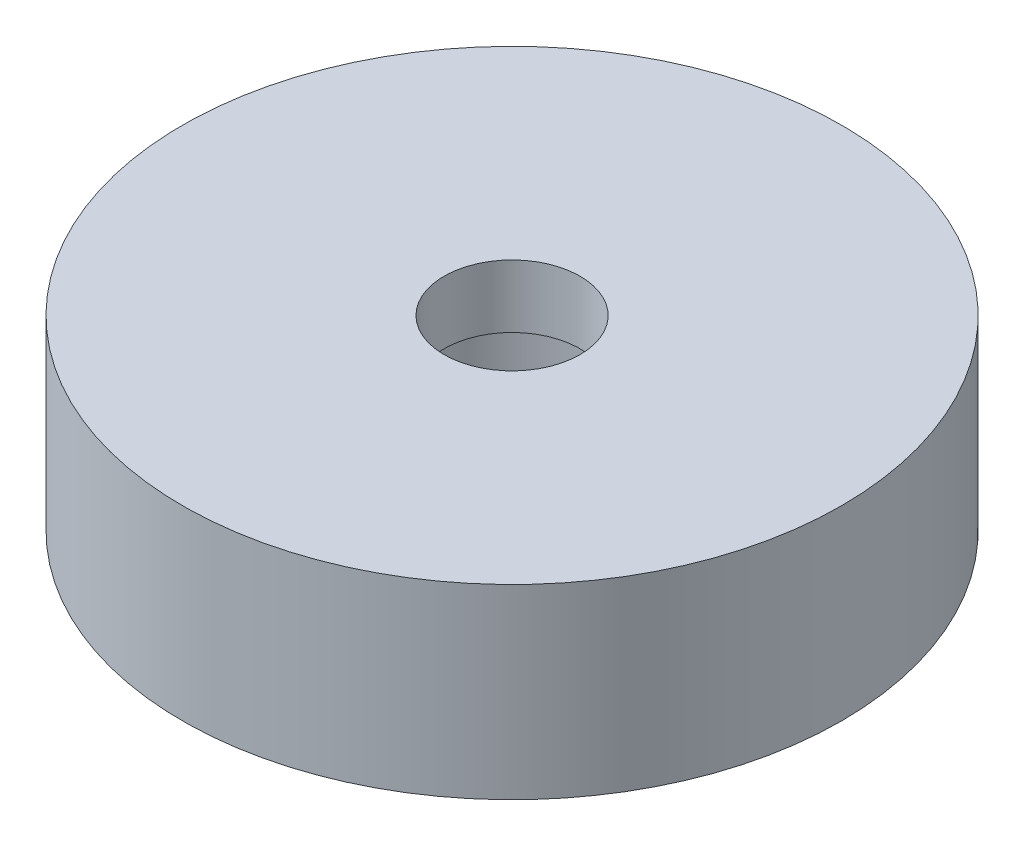
ISO-10303-21;
HEADER;
FILE_DESCRIPTION(('STEP AP214'),'2;1');
FILE_NAME('part.step','',(''),(''),'','','');
FILE_SCHEMA(('AUTOMOTIVE_DESIGN { 1 0 10303 214 1 1 1 1 }'));
ENDSEC;
DATA;
#1=APPLICATION_CONTEXT('core data for automotive mechanical design processes');
#2=APPLICATION_PROTOCOL_DEFINITION('international standard','automotive_design',2000,#1);
#3=PRODUCT_CONTEXT('',#1,'mechanical');
#4=PRODUCT('Part','Part','',(#3));
#5=PRODUCT_RELATED_PRODUCT_CATEGORY('part','',(#4));
#6=PRODUCT_DEFINITION_FORMATION('','',#4);
#7=PRODUCT_DEFINITION_CONTEXT('part definition',#1,'design');
#8=PRODUCT_DEFINITION('design','',#6,#7);
#9=PRODUCT_DEFINITION_SHAPE('','',#8);
#10=(LENGTH_UNIT() NAMED_UNIT(*) SI_UNIT(.MILLI.,.METRE.));
#11=(NAMED_UNIT(*) PLANE_ANGLE_UNIT() SI_UNIT($,.RADIAN.));
#12=(NAMED_UNIT(*) SI_UNIT($,.STERADIAN.) SOLID_ANGLE_UNIT());
#13=UNCERTAINTY_MEASURE_WITH_UNIT(LENGTH_MEASURE(1.E-05),#10,'distance_accuracy_value','');
#14=(GEOMETRIC_REPRESENTATION_CONTEXT(3) GLOBAL_UNCERTAINTY_ASSIGNED_CONTEXT((#13)) GLOBAL_UNIT_ASSIGNED_CONTEXT((#10,
#11,#12)) REPRESENTATION_CONTEXT('',''));
#15=CARTESIAN_POINT('',(0.,0.,0.));
#16=DIRECTION('',(0.,0.,1.));
#17=DIRECTION('',(1.,0.,0.));
#18=AXIS2_PLACEMENT_3D('',#15,#16,#17);
#19=CARTESIAN_POINT('',(8.,0.,0.));
#20=DIRECTION('',(0.,-1.,0.));
#21=DIRECTION('',(1.,0.,0.));
#22=AXIS2_PLACEMENT_3D('',#19,#20,#21);
#23=PLANE('',#22);
#24=CARTESIAN_POINT('',(0.,0.,0.));
#25=DIRECTION('',(0.,-1.,0.));
#26=DIRECTION('',(1.,0.,0.));
#27=AXIS2_PLACEMENT_3D('',#24,#25,#26);
#28=CIRCLE('',#27,8.);
#29=CARTESIAN_POINT('',(8.,0.,0.));
#30=VERTEX_POINT('',#29);
#31=EDGE_CURVE('E70',#30,#30,#28,.T.);
#32=ORIENTED_EDGE('',*,*,#31,.T.);
#33=EDGE_LOOP('',(#32));
#34=FACE_BOUND('',#33,.T.);
#35=CARTESIAN_POINT('',(0.,0.,0.));
#36=DIRECTION('',(0.,-1.,0.));
#37=DIRECTION('',(1.,0.,0.));
#38=AXIS2_PLACEMENT_3D('',#35,#36,#37);
#39=CIRCLE('',#38,2.8);
#40=CARTESIAN_POINT('',(2.8,0.,0.));
#41=VERTEX_POINT('',#40);
#42=EDGE_CURVE('E10',#41,#41,#39,.T.);
#43=ORIENTED_EDGE('',*,*,#42,.F.);
#44=EDGE_LOOP('',(#43));
#45=FACE_BOUND('',#44,.T.);
#46=ADVANCED_FACE('F43',(#34,#45),#23,.T.);
#47=CARTESIAN_POINT('',(8.62565021600784E-13,-251.45842820185,0.));
#48=DIRECTION('',(0.,-1.,0.));
#49=DIRECTION('',(1.,0.,0.));
#50=AXIS2_PLACEMENT_3D('',#47,#48,#49);
#51=CYLINDRICAL_SURFACE('',#50,2.80000000000001);
#52=ORIENTED_EDGE('',*,*,#42,.T.);
#53=EDGE_LOOP('',(#52));
#54=FACE_BOUND('',#53,.T.);
#55=CARTESIAN_POINT('',(0.,3.,0.));
#56=DIRECTION('',(0.,-1.,0.));
#57=DIRECTION('',(1.,0.,0.));
#58=AXIS2_PLACEMENT_3D('',#55,#56,#57);
#59=CIRCLE('',#58,2.80000000000001);
#60=CARTESIAN_POINT('',(2.8,3.00000000000001,0.));
#61=VERTEX_POINT('',#60);
#62=EDGE_CURVE('E50',#61,#61,#59,.T.);
#63=ORIENTED_EDGE('',*,*,#62,.F.);
#64=EDGE_LOOP('',(#63));
#65=FACE_BOUND('',#64,.T.);
#66=ADVANCED_FACE('F89',(#54,#65),#51,.F.);
#67=CARTESIAN_POINT('',(2.8,3.,0.));
#68=DIRECTION('',(0.,-1.,0.));
#69=DIRECTION('',(1.,0.,0.));
#70=AXIS2_PLACEMENT_3D('',#67,#68,#69);
#71=PLANE('',#70);
#72=ORIENTED_EDGE('',*,*,#62,.T.);
#73=EDGE_LOOP('',(#72));
#74=FACE_BOUND('',#73,.T.);
#75=CARTESIAN_POINT('',(0.,3.,0.));
#76=DIRECTION('',(0.,-1.,0.));
#77=DIRECTION('',(1.,0.,0.));
#78=AXIS2_PLACEMENT_3D('',#75,#76,#77);
#79=CIRCLE('',#78,1.65000000000001);
#80=CARTESIAN_POINT('',(1.65,3.00000000000001,0.));
#81=VERTEX_POINT('',#80);
#82=EDGE_CURVE('E55',#81,#81,#79,.T.);
#83=ORIENTED_EDGE('',*,*,#82,.F.);
#84=EDGE_LOOP('',(#83));
#85=FACE_BOUND('',#84,.T.);
#86=ADVANCED_FACE('F93',(#74,#85),#71,.T.);
#87=CARTESIAN_POINT('',(8.62565021600784E-13,-251.45842820185,0.));
#88=DIRECTION('',(0.,-1.,0.));
#89=DIRECTION('',(1.,0.,0.));
#90=AXIS2_PLACEMENT_3D('',#87,#88,#89);
#91=CYLINDRICAL_SURFACE('',#90,1.65000000000001);
#92=ORIENTED_EDGE('',*,*,#82,.T.);
#93=EDGE_LOOP('',(#92));
#94=FACE_BOUND('',#93,.T.);
#95=CARTESIAN_POINT('',(0.,4.525,0.));
#96=DIRECTION('',(0.,-1.,0.));
#97=DIRECTION('',(1.,0.,0.));
#98=AXIS2_PLACEMENT_3D('',#95,#96,#97);
#99=CIRCLE('',#98,1.65000000000002);
#100=CARTESIAN_POINT('',(1.65,4.52500000000001,0.));
#101=VERTEX_POINT('',#100);
#102=EDGE_CURVE('E60',#101,#101,#99,.T.);
#103=ORIENTED_EDGE('',*,*,#102,.F.);
#104=EDGE_LOOP('',(#103));
#105=FACE_BOUND('',#104,.T.);
#106=ADVANCED_FACE('F85',(#94,#105),#91,.F.);
#107=CARTESIAN_POINT('',(1.65,4.52499999999999,0.));
#108=DIRECTION('',(0.,1.,0.));
#109=DIRECTION('',(-1.,0.,0.));
#110=AXIS2_PLACEMENT_3D('',#107,#108,#109);
#111=PLANE('',#110);
#112=ORIENTED_EDGE('',*,*,#102,.T.);
#113=EDGE_LOOP('',(#112));
#114=FACE_BOUND('',#113,.T.);
#115=CARTESIAN_POINT('',(0.,4.525,0.));
#116=DIRECTION('',(0.,-1.,0.));
#117=DIRECTION('',(1.,0.,0.));
#118=AXIS2_PLACEMENT_3D('',#115,#116,#117);
#119=CIRCLE('',#118,8.00000000000002);
#120=CARTESIAN_POINT('',(8.,4.52500000000003,0.));
#121=VERTEX_POINT('',#120);
#122=EDGE_CURVE('E66',#121,#121,#119,.T.);
#123=ORIENTED_EDGE('',*,*,#122,.F.);
#124=EDGE_LOOP('',(#123));
#125=FACE_BOUND('',#124,.T.);
#126=ADVANCED_FACE('F79',(#114,#125),#111,.T.);
#127=CARTESIAN_POINT('',(8.62565021600784E-13,-251.45842820185,0.));
#128=DIRECTION('',(0.,-1.,0.));
#129=DIRECTION('',(1.,0.,0.));
#130=AXIS2_PLACEMENT_3D('',#127,#128,#129);
#131=CYLINDRICAL_SURFACE('',#130,8.00000000000001);
#132=ORIENTED_EDGE('',*,*,#122,.T.);
#133=EDGE_LOOP('',(#132));
#134=FACE_BOUND('',#133,.T.);
#135=ORIENTED_EDGE('',*,*,#31,.F.);
#136=EDGE_LOOP('',(#135));
#137=FACE_BOUND('',#136,.T.);
#138=ADVANCED_FACE('F77',(#134,#137),#131,.T.);
#139=CLOSED_SHELL('',(#46,#66,#86,#106,#126,#138));
#140=MANIFOLD_SOLID_BREP('B2',#139);
#141=ADVANCED_BREP_SHAPE_REPRESENTATION('',(#18,#140),#14);
#142=SHAPE_DEFINITION_REPRESENTATION(#9,#141);
ENDSEC;
END-ISO-10303-21;
